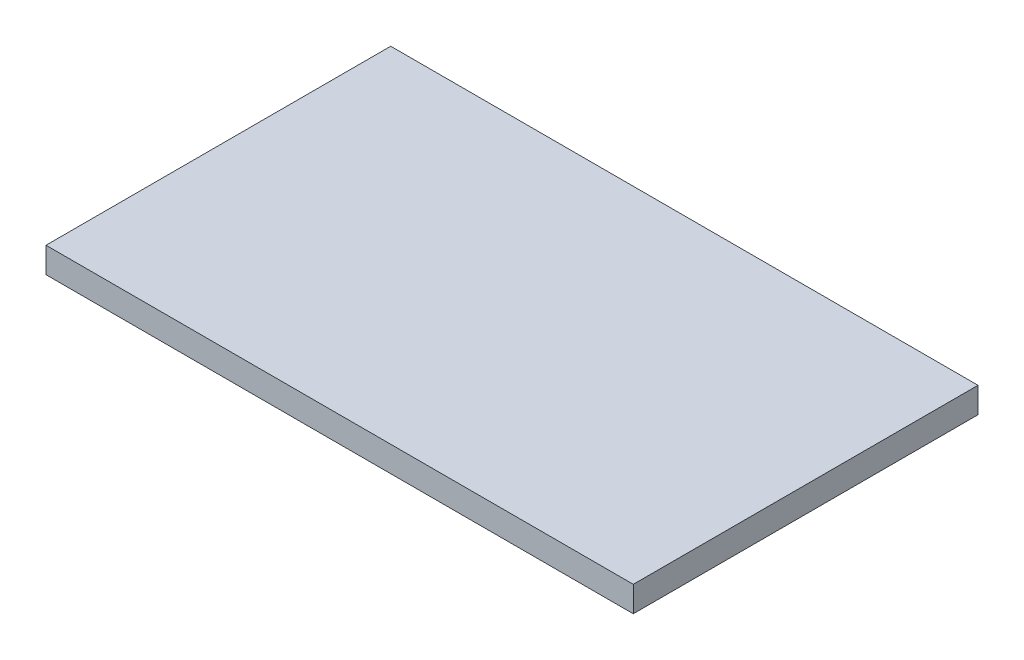
ISO-10303-21;
HEADER;
FILE_DESCRIPTION(('STEP AP214'),'2;1');
FILE_NAME('part.step','',(''),(''),'','','');
FILE_SCHEMA(('AUTOMOTIVE_DESIGN { 1 0 10303 214 1 1 1 1 }'));
ENDSEC;
DATA;
#1=APPLICATION_CONTEXT('core data for automotive mechanical design processes');
#2=APPLICATION_PROTOCOL_DEFINITION('international standard','automotive_design',2000,#1);
#3=PRODUCT_CONTEXT('',#1,'mechanical');
#4=PRODUCT('Part','Part','',(#3));
#5=PRODUCT_RELATED_PRODUCT_CATEGORY('part','',(#4));
#6=PRODUCT_DEFINITION_FORMATION('','',#4);
#7=PRODUCT_DEFINITION_CONTEXT('part definition',#1,'design');
#8=PRODUCT_DEFINITION('design','',#6,#7);
#9=PRODUCT_DEFINITION_SHAPE('','',#8);
#10=(LENGTH_UNIT() NAMED_UNIT(*) SI_UNIT(.MILLI.,.METRE.));
#11=(NAMED_UNIT(*) PLANE_ANGLE_UNIT() SI_UNIT($,.RADIAN.));
#12=(NAMED_UNIT(*) SI_UNIT($,.STERADIAN.) SOLID_ANGLE_UNIT());
#13=UNCERTAINTY_MEASURE_WITH_UNIT(LENGTH_MEASURE(1.E-05),#10,'distance_accuracy_value','');
#14=(GEOMETRIC_REPRESENTATION_CONTEXT(3) GLOBAL_UNCERTAINTY_ASSIGNED_CONTEXT((#13)) GLOBAL_UNIT_ASSIGNED_CONTEXT((#10,
#11,#12)) REPRESENTATION_CONTEXT('',''));
#15=CARTESIAN_POINT('',(0.,0.,0.));
#16=DIRECTION('',(0.,0.,1.));
#17=DIRECTION('',(1.,0.,0.));
#18=AXIS2_PLACEMENT_3D('',#15,#16,#17);
#19=CARTESIAN_POINT('',(36.5125,3.175,21.43125));
#20=DIRECTION('',(-1.,0.,0.));
#21=DIRECTION('',(0.,0.,1.));
#22=AXIS2_PLACEMENT_3D('',#19,#20,#21);
#23=PLANE('',#22);
#24=DIRECTION('',(0.,0.,-1.));
#25=VECTOR('',#24,1.);
#26=CARTESIAN_POINT('',(36.5125,0.,21.43125));
#27=LINE('',#26,#25);
#28=CARTESIAN_POINT('',(36.5125,0.,21.43125));
#29=VERTEX_POINT('',#28);
#30=CARTESIAN_POINT('',(36.5125,0.,-21.43125));
#31=VERTEX_POINT('',#30);
#32=EDGE_CURVE('E107',#29,#31,#27,.T.);
#33=ORIENTED_EDGE('',*,*,#32,.T.);
#34=DIRECTION('',(0.,-1.,0.));
#35=VECTOR('',#34,1.);
#36=CARTESIAN_POINT('',(36.5125,3.175,-21.43125));
#37=LINE('',#36,#35);
#38=CARTESIAN_POINT('',(36.5125,3.175,-21.43125));
#39=VERTEX_POINT('',#38);
#40=EDGE_CURVE('E11',#39,#31,#37,.T.);
#41=ORIENTED_EDGE('',*,*,#40,.F.);
#42=DIRECTION('',(0.,0.,-1.));
#43=VECTOR('',#42,1.);
#44=CARTESIAN_POINT('',(36.5125,3.175,21.43125));
#45=LINE('',#44,#43);
#46=CARTESIAN_POINT('',(36.5125,3.175,21.43125));
#47=VERTEX_POINT('',#46);
#48=EDGE_CURVE('E91',#47,#39,#45,.T.);
#49=ORIENTED_EDGE('',*,*,#48,.F.);
#50=DIRECTION('',(0.,-1.,0.));
#51=VECTOR('',#50,1.);
#52=CARTESIAN_POINT('',(36.5125,3.175,21.43125));
#53=LINE('',#52,#51);
#54=EDGE_CURVE('E103',#47,#29,#53,.T.);
#55=ORIENTED_EDGE('',*,*,#54,.T.);
#56=EDGE_LOOP('',(#33,#41,#49,#55));
#57=FACE_BOUND('',#56,.T.);
#58=ADVANCED_FACE('F39',(#57),#23,.F.);
#59=CARTESIAN_POINT('',(-36.5125,3.175,-21.43125));
#60=DIRECTION('',(0.,0.,1.));
#61=DIRECTION('',(1.,0.,0.));
#62=AXIS2_PLACEMENT_3D('',#59,#60,#61);
#63=PLANE('',#62);
#64=DIRECTION('',(-1.,0.,0.));
#65=VECTOR('',#64,1.);
#66=CARTESIAN_POINT('',(-36.5125,0.,-21.43125));
#67=LINE('',#66,#65);
#68=CARTESIAN_POINT('',(-36.5125,0.,-21.43125));
#69=VERTEX_POINT('',#68);
#70=EDGE_CURVE('E96',#31,#69,#67,.T.);
#71=ORIENTED_EDGE('',*,*,#70,.T.);
#72=DIRECTION('',(0.,-1.,0.));
#73=VECTOR('',#72,1.);
#74=CARTESIAN_POINT('',(-36.5125,3.175,-21.43125));
#75=LINE('',#74,#73);
#76=CARTESIAN_POINT('',(-36.5125,3.175,-21.43125));
#77=VERTEX_POINT('',#76);
#78=EDGE_CURVE('E48',#77,#69,#75,.T.);
#79=ORIENTED_EDGE('',*,*,#78,.F.);
#80=DIRECTION('',(-1.,0.,0.));
#81=VECTOR('',#80,1.);
#82=CARTESIAN_POINT('',(-36.5125,3.175,-21.43125));
#83=LINE('',#82,#81);
#84=EDGE_CURVE('E86',#39,#77,#83,.T.);
#85=ORIENTED_EDGE('',*,*,#84,.F.);
#86=ORIENTED_EDGE('',*,*,#40,.T.);
#87=EDGE_LOOP('',(#71,#79,#85,#86));
#88=FACE_BOUND('',#87,.T.);
#89=ADVANCED_FACE('F95',(#88),#63,.F.);
#90=CARTESIAN_POINT('',(-36.5125,3.175,21.43125));
#91=DIRECTION('',(1.,0.,0.));
#92=DIRECTION('',(0.,0.,-1.));
#93=AXIS2_PLACEMENT_3D('',#90,#91,#92);
#94=PLANE('',#93);
#95=DIRECTION('',(0.,0.,1.));
#96=VECTOR('',#95,1.);
#97=CARTESIAN_POINT('',(-36.5125,0.,21.43125));
#98=LINE('',#97,#96);
#99=CARTESIAN_POINT('',(-36.5125,0.,21.43125));
#100=VERTEX_POINT('',#99);
#101=EDGE_CURVE('E73',#69,#100,#98,.T.);
#102=ORIENTED_EDGE('',*,*,#101,.T.);
#103=DIRECTION('',(0.,-1.,0.));
#104=VECTOR('',#103,1.);
#105=CARTESIAN_POINT('',(-36.5125,3.175,21.43125));
#106=LINE('',#105,#104);
#107=CARTESIAN_POINT('',(-36.5125,3.175,21.43125));
#108=VERTEX_POINT('',#107);
#109=EDGE_CURVE('E98',#108,#100,#106,.T.);
#110=ORIENTED_EDGE('',*,*,#109,.F.);
#111=DIRECTION('',(0.,0.,1.));
#112=VECTOR('',#111,1.);
#113=CARTESIAN_POINT('',(-36.5125,3.175,21.43125));
#114=LINE('',#113,#112);
#115=EDGE_CURVE('E89',#77,#108,#114,.T.);
#116=ORIENTED_EDGE('',*,*,#115,.F.);
#117=ORIENTED_EDGE('',*,*,#78,.T.);
#118=EDGE_LOOP('',(#102,#110,#116,#117));
#119=FACE_BOUND('',#118,.T.);
#120=ADVANCED_FACE('F99',(#119),#94,.F.);
#121=CARTESIAN_POINT('',(-36.5125,3.175,21.43125));
#122=DIRECTION('',(0.,0.,-1.));
#123=DIRECTION('',(-1.,0.,0.));
#124=AXIS2_PLACEMENT_3D('',#121,#122,#123);
#125=PLANE('',#124);
#126=DIRECTION('',(1.,0.,0.));
#127=VECTOR('',#126,1.);
#128=CARTESIAN_POINT('',(-36.5125,0.,21.43125));
#129=LINE('',#128,#127);
#130=EDGE_CURVE('E79',#100,#29,#129,.T.);
#131=ORIENTED_EDGE('',*,*,#130,.T.);
#132=ORIENTED_EDGE('',*,*,#54,.F.);
#133=DIRECTION('',(1.,0.,0.));
#134=VECTOR('',#133,1.);
#135=CARTESIAN_POINT('',(-36.5125,3.175,21.43125));
#136=LINE('',#135,#134);
#137=EDGE_CURVE('E56',#108,#47,#136,.T.);
#138=ORIENTED_EDGE('',*,*,#137,.F.);
#139=ORIENTED_EDGE('',*,*,#109,.T.);
#140=EDGE_LOOP('',(#131,#132,#138,#139));
#141=FACE_BOUND('',#140,.T.);
#142=ADVANCED_FACE('F120',(#141),#125,.F.);
#143=CARTESIAN_POINT('',(0.,3.175,0.));
#144=DIRECTION('',(0.,-1.,0.));
#145=DIRECTION('',(0.,0.,-1.));
#146=AXIS2_PLACEMENT_3D('',#143,#144,#145);
#147=PLANE('',#146);
#148=ORIENTED_EDGE('',*,*,#48,.T.);
#149=ORIENTED_EDGE('',*,*,#84,.T.);
#150=ORIENTED_EDGE('',*,*,#115,.T.);
#151=ORIENTED_EDGE('',*,*,#137,.T.);
#152=EDGE_LOOP('',(#148,#149,#150,#151));
#153=FACE_BOUND('',#152,.T.);
#154=ADVANCED_FACE('F87',(#153),#147,.F.);
#155=CARTESIAN_POINT('',(0.,0.,0.));
#156=DIRECTION('',(0.,-1.,0.));
#157=DIRECTION('',(0.,0.,-1.));
#158=AXIS2_PLACEMENT_3D('',#155,#156,#157);
#159=PLANE('',#158);
#160=ORIENTED_EDGE('',*,*,#32,.F.);
#161=ORIENTED_EDGE('',*,*,#130,.F.);
#162=ORIENTED_EDGE('',*,*,#101,.F.);
#163=ORIENTED_EDGE('',*,*,#70,.F.);
#164=EDGE_LOOP('',(#160,#161,#162,#163));
#165=FACE_BOUND('',#164,.T.);
#166=ADVANCED_FACE('F123',(#165),#159,.T.);
#167=CLOSED_SHELL('',(#58,#89,#120,#142,#154,#166));
#168=MANIFOLD_SOLID_BREP('B2',#167);
#169=ADVANCED_BREP_SHAPE_REPRESENTATION('',(#18,#168),#14);
#170=SHAPE_DEFINITION_REPRESENTATION(#9,#169);
ENDSEC;
END-ISO-10303-21;
